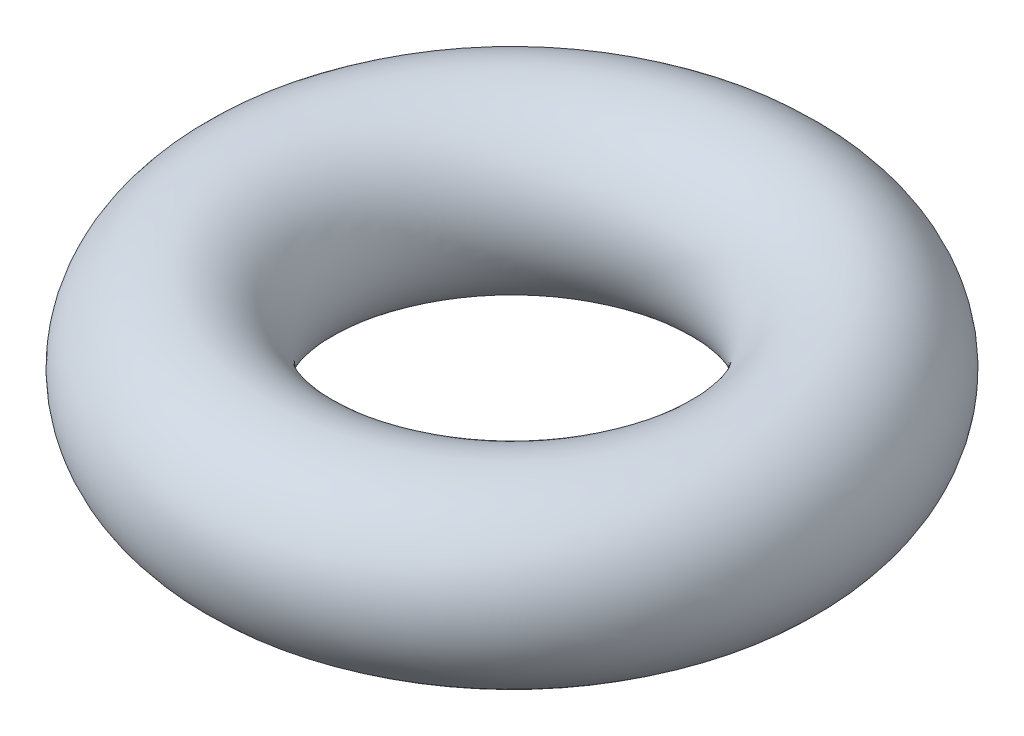
ISO-10303-21;
HEADER;
FILE_DESCRIPTION(('STEP AP214'),'2;1');
FILE_NAME('part.step','',(''),(''),'','','');
FILE_SCHEMA(('AUTOMOTIVE_DESIGN { 1 0 10303 214 1 1 1 1 }'));
ENDSEC;
DATA;
#1=APPLICATION_CONTEXT('core data for automotive mechanical design processes');
#2=APPLICATION_PROTOCOL_DEFINITION('international standard','automotive_design',2000,#1);
#3=PRODUCT_CONTEXT('',#1,'mechanical');
#4=PRODUCT('Part','Part','',(#3));
#5=PRODUCT_RELATED_PRODUCT_CATEGORY('part','',(#4));
#6=PRODUCT_DEFINITION_FORMATION('','',#4);
#7=PRODUCT_DEFINITION_CONTEXT('part definition',#1,'design');
#8=PRODUCT_DEFINITION('design','',#6,#7);
#9=PRODUCT_DEFINITION_SHAPE('','',#8);
#10=(LENGTH_UNIT() NAMED_UNIT(*) SI_UNIT(.MILLI.,.METRE.));
#11=(NAMED_UNIT(*) PLANE_ANGLE_UNIT() SI_UNIT($,.RADIAN.));
#12=(NAMED_UNIT(*) SI_UNIT($,.STERADIAN.) SOLID_ANGLE_UNIT());
#13=UNCERTAINTY_MEASURE_WITH_UNIT(LENGTH_MEASURE(1.E-05),#10,'distance_accuracy_value','');
#14=(GEOMETRIC_REPRESENTATION_CONTEXT(3) GLOBAL_UNCERTAINTY_ASSIGNED_CONTEXT((#13)) GLOBAL_UNIT_ASSIGNED_CONTEXT((#10,
#11,#12)) REPRESENTATION_CONTEXT('',''));
#15=CARTESIAN_POINT('',(0.,0.,0.));
#16=DIRECTION('',(0.,0.,1.));
#17=DIRECTION('',(1.,0.,0.));
#18=AXIS2_PLACEMENT_3D('',#15,#16,#17);
#19=CARTESIAN_POINT('',(0.,0.,0.));
#20=DIRECTION('',(0.,1.,0.));
#21=DIRECTION('',(0.,0.,1.));
#22=AXIS2_PLACEMENT_3D('',#19,#20,#21);
#23=TOROIDAL_SURFACE('',#22,2.75,1.);
#24=CARTESIAN_POINT('',(0.,0.,3.75));
#25=VERTEX_POINT('',#24);
#26=VERTEX_LOOP('',#25);
#27=FACE_BOUND('',#26,.T.);
#28=ADVANCED_FACE('F32',(#27),#23,.T.);
#29=CLOSED_SHELL('',(#28));
#30=MANIFOLD_SOLID_BREP('B2',#29);
#31=ADVANCED_BREP_SHAPE_REPRESENTATION('',(#18,#30),#14);
#32=SHAPE_DEFINITION_REPRESENTATION(#9,#31);
ENDSEC;
END-ISO-10303-21;
